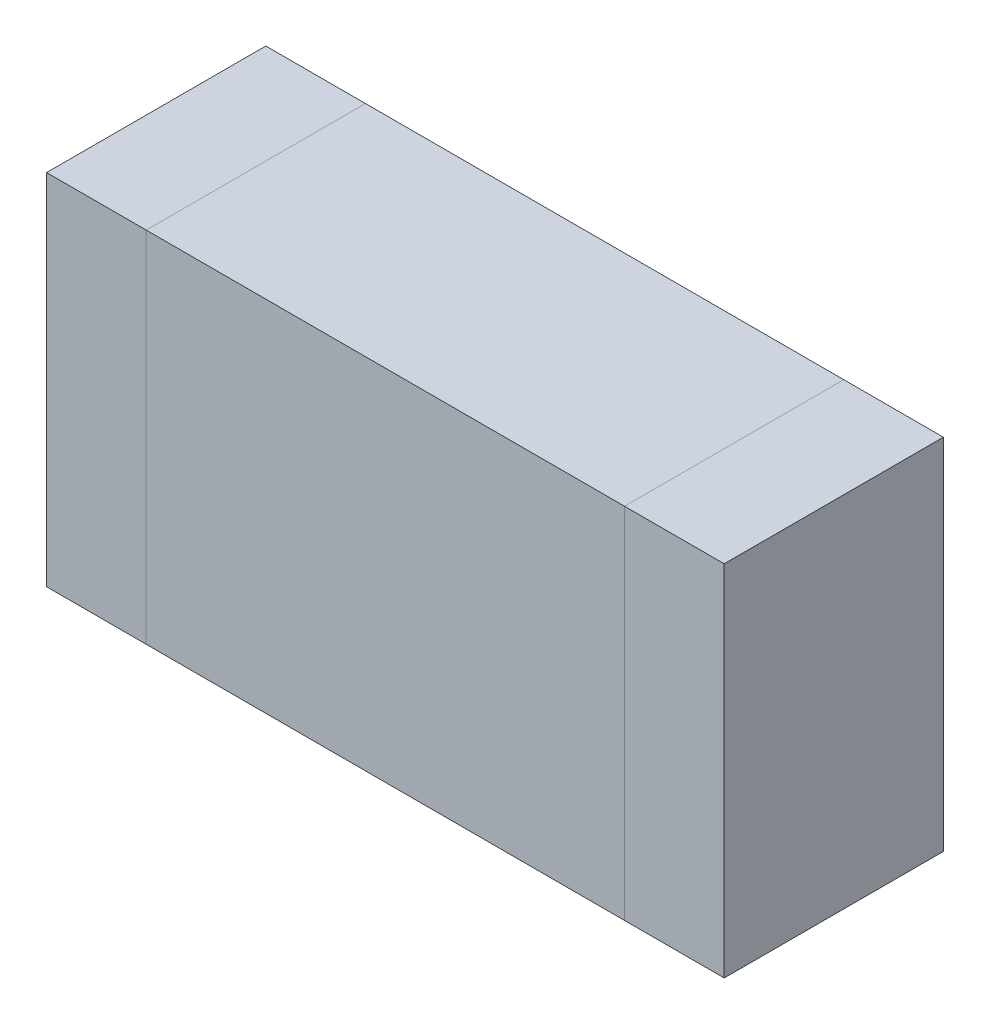
ISO-10303-21;
HEADER;
FILE_DESCRIPTION(('STEP AP214'),'2;1');
FILE_NAME('part.step','',(''),(''),'','','');
FILE_SCHEMA(('AUTOMOTIVE_DESIGN { 1 0 10303 214 1 1 1 1 }'));
ENDSEC;
DATA;
#1=APPLICATION_CONTEXT('core data for automotive mechanical design processes');
#2=APPLICATION_PROTOCOL_DEFINITION('international standard','automotive_design',2000,#1);
#3=PRODUCT_CONTEXT('',#1,'mechanical');
#4=PRODUCT('Part','Part','',(#3));
#5=PRODUCT_RELATED_PRODUCT_CATEGORY('part','',(#4));
#6=PRODUCT_DEFINITION_FORMATION('','',#4);
#7=PRODUCT_DEFINITION_CONTEXT('part definition',#1,'design');
#8=PRODUCT_DEFINITION('design','',#6,#7);
#9=PRODUCT_DEFINITION_SHAPE('','',#8);
#10=(LENGTH_UNIT() NAMED_UNIT(*) SI_UNIT(.MILLI.,.METRE.));
#11=(NAMED_UNIT(*) PLANE_ANGLE_UNIT() SI_UNIT($,.RADIAN.));
#12=(NAMED_UNIT(*) SI_UNIT($,.STERADIAN.) SOLID_ANGLE_UNIT());
#13=UNCERTAINTY_MEASURE_WITH_UNIT(LENGTH_MEASURE(1.E-05),#10,'distance_accuracy_value','');
#14=(GEOMETRIC_REPRESENTATION_CONTEXT(3) GLOBAL_UNCERTAINTY_ASSIGNED_CONTEXT((#13)) GLOBAL_UNIT_ASSIGNED_CONTEXT((#10,
#11,#12)) REPRESENTATION_CONTEXT('',''));
#15=CARTESIAN_POINT('',(0.,0.,0.));
#16=DIRECTION('',(0.,0.,1.));
#17=DIRECTION('',(1.,0.,0.));
#18=AXIS2_PLACEMENT_3D('',#15,#16,#17);
#19=CARTESIAN_POINT('',(-1.20000014,0.8999982,0.));
#20=DIRECTION('',(1.,0.,0.));
#21=DIRECTION('',(0.,-1.,0.));
#22=AXIS2_PLACEMENT_3D('',#19,#20,#21);
#23=PLANE('',#22);
#24=DIRECTION('',(0.,-1.,0.));
#25=VECTOR('',#24,1.);
#26=CARTESIAN_POINT('',(-1.20000014,0.8999982,0.));
#27=LINE('',#26,#25);
#28=CARTESIAN_POINT('',(-1.20000014,0.8999982,0.));
#29=VERTEX_POINT('',#28);
#30=CARTESIAN_POINT('',(-1.20000014,-0.90000074,0.));
#31=VERTEX_POINT('',#30);
#32=EDGE_CURVE('P0_E10',#29,#31,#27,.T.);
#33=ORIENTED_EDGE('',*,*,#32,.T.);
#34=DIRECTION('',(0.,0.,1.));
#35=VECTOR('',#34,1.);
#36=CARTESIAN_POINT('',(-1.20000014,-0.90000074,0.));
#37=LINE('',#36,#35);
#38=CARTESIAN_POINT('',(-1.20000014,-0.90000074,1.10000034));
#39=VERTEX_POINT('',#38);
#40=EDGE_CURVE('P0_E23',#31,#39,#37,.T.);
#41=ORIENTED_EDGE('',*,*,#40,.T.);
#42=DIRECTION('',(0.,-1.,0.));
#43=VECTOR('',#42,1.);
#44=CARTESIAN_POINT('',(-1.20000014,0.8999982,1.10000034));
#45=LINE('',#44,#43);
#46=CARTESIAN_POINT('',(-1.20000014,0.8999982,1.10000034));
#47=VERTEX_POINT('',#46);
#48=EDGE_CURVE('P0_E85',#47,#39,#45,.T.);
#49=ORIENTED_EDGE('',*,*,#48,.F.);
#50=DIRECTION('',(0.,0.,1.));
#51=VECTOR('',#50,1.);
#52=CARTESIAN_POINT('',(-1.20000014,0.8999982,0.));
#53=LINE('',#52,#51);
#54=EDGE_CURVE('P0_E33',#29,#47,#53,.T.);
#55=ORIENTED_EDGE('',*,*,#54,.F.);
#56=EDGE_LOOP('',(#33,#41,#49,#55));
#57=FACE_BOUND('',#56,.T.);
#58=ADVANCED_FACE('P0_F16',(#57),#23,.F.);
#59=CARTESIAN_POINT('',(-1.20000014,-0.90000074,0.));
#60=DIRECTION('',(0.,1.,0.));
#61=DIRECTION('',(1.,0.,0.));
#62=AXIS2_PLACEMENT_3D('',#59,#60,#61);
#63=PLANE('',#62);
#64=DIRECTION('',(1.,0.,0.));
#65=VECTOR('',#64,1.);
#66=CARTESIAN_POINT('',(-1.20000014,-0.90000074,0.));
#67=LINE('',#66,#65);
#68=CARTESIAN_POINT('',(1.20000014,-0.90000074,0.));
#69=VERTEX_POINT('',#68);
#70=EDGE_CURVE('P0_E81',#31,#69,#67,.T.);
#71=ORIENTED_EDGE('',*,*,#70,.T.);
#72=DIRECTION('',(0.,0.,1.));
#73=VECTOR('',#72,1.);
#74=CARTESIAN_POINT('',(1.20000014,-0.90000074,0.));
#75=LINE('',#74,#73);
#76=CARTESIAN_POINT('',(1.20000014,-0.90000074,1.10000034));
#77=VERTEX_POINT('',#76);
#78=EDGE_CURVE('P0_E79',#69,#77,#75,.T.);
#79=ORIENTED_EDGE('',*,*,#78,.T.);
#80=DIRECTION('',(1.,0.,0.));
#81=VECTOR('',#80,1.);
#82=CARTESIAN_POINT('',(-1.20000014,-0.90000074,1.10000034));
#83=LINE('',#82,#81);
#84=EDGE_CURVE('P0_E66',#39,#77,#83,.T.);
#85=ORIENTED_EDGE('',*,*,#84,.F.);
#86=ORIENTED_EDGE('',*,*,#40,.F.);
#87=EDGE_LOOP('',(#71,#79,#85,#86));
#88=FACE_BOUND('',#87,.T.);
#89=ADVANCED_FACE('P0_F88',(#88),#63,.F.);
#90=CARTESIAN_POINT('',(1.20000014,-0.90000074,0.));
#91=DIRECTION('',(-1.,0.,0.));
#92=DIRECTION('',(0.,1.,0.));
#93=AXIS2_PLACEMENT_3D('',#90,#91,#92);
#94=PLANE('',#93);
#95=DIRECTION('',(0.,1.,0.));
#96=VECTOR('',#95,1.);
#97=CARTESIAN_POINT('',(1.20000014,-0.90000074,0.));
#98=LINE('',#97,#96);
#99=CARTESIAN_POINT('',(1.20000014,0.8999982,0.));
#100=VERTEX_POINT('',#99);
#101=EDGE_CURVE('P0_E72',#69,#100,#98,.T.);
#102=ORIENTED_EDGE('',*,*,#101,.T.);
#103=DIRECTION('',(0.,0.,1.));
#104=VECTOR('',#103,1.);
#105=CARTESIAN_POINT('',(1.20000014,0.8999982,0.));
#106=LINE('',#105,#104);
#107=CARTESIAN_POINT('',(1.20000014,0.8999982,1.10000034));
#108=VERTEX_POINT('',#107);
#109=EDGE_CURVE('P0_E58',#100,#108,#106,.T.);
#110=ORIENTED_EDGE('',*,*,#109,.T.);
#111=DIRECTION('',(0.,1.,0.));
#112=VECTOR('',#111,1.);
#113=CARTESIAN_POINT('',(1.20000014,-0.90000074,1.10000034));
#114=LINE('',#113,#112);
#115=EDGE_CURVE('P0_E63',#77,#108,#114,.T.);
#116=ORIENTED_EDGE('',*,*,#115,.F.);
#117=ORIENTED_EDGE('',*,*,#78,.F.);
#118=EDGE_LOOP('',(#102,#110,#116,#117));
#119=FACE_BOUND('',#118,.T.);
#120=ADVANCED_FACE('P0_F71',(#119),#94,.F.);
#121=CARTESIAN_POINT('',(1.20000014,0.8999982,0.));
#122=DIRECTION('',(0.,-1.,0.));
#123=DIRECTION('',(-1.,0.,0.));
#124=AXIS2_PLACEMENT_3D('',#121,#122,#123);
#125=PLANE('',#124);
#126=DIRECTION('',(-1.,0.,0.));
#127=VECTOR('',#126,1.);
#128=CARTESIAN_POINT('',(1.20000014,0.8999982,0.));
#129=LINE('',#128,#127);
#130=EDGE_CURVE('P0_E60',#100,#29,#129,.T.);
#131=ORIENTED_EDGE('',*,*,#130,.T.);
#132=ORIENTED_EDGE('',*,*,#54,.T.);
#133=DIRECTION('',(-1.,0.,0.));
#134=VECTOR('',#133,1.);
#135=CARTESIAN_POINT('',(1.20000014,0.8999982,1.10000034));
#136=LINE('',#135,#134);
#137=EDGE_CURVE('P0_E53',#108,#47,#136,.T.);
#138=ORIENTED_EDGE('',*,*,#137,.F.);
#139=ORIENTED_EDGE('',*,*,#109,.F.);
#140=EDGE_LOOP('',(#131,#132,#138,#139));
#141=FACE_BOUND('',#140,.T.);
#142=ADVANCED_FACE('P0_F56',(#141),#125,.F.);
#143=CARTESIAN_POINT('',(-1.20000014,0.8999982,0.));
#144=DIRECTION('',(0.,0.,-1.));
#145=DIRECTION('',(0.,1.,0.));
#146=AXIS2_PLACEMENT_3D('',#143,#144,#145);
#147=PLANE('',#146);
#148=ORIENTED_EDGE('',*,*,#130,.F.);
#149=ORIENTED_EDGE('',*,*,#101,.F.);
#150=ORIENTED_EDGE('',*,*,#70,.F.);
#151=ORIENTED_EDGE('',*,*,#32,.F.);
#152=EDGE_LOOP('',(#148,#149,#150,#151));
#153=FACE_BOUND('',#152,.T.);
#154=ADVANCED_FACE('P0_F90',(#153),#147,.T.);
#155=CARTESIAN_POINT('',(-1.20000014,0.8999982,1.10000034));
#156=DIRECTION('',(0.,0.,-1.));
#157=DIRECTION('',(0.,1.,0.));
#158=AXIS2_PLACEMENT_3D('',#155,#156,#157);
#159=PLANE('',#158);
#160=ORIENTED_EDGE('',*,*,#48,.T.);
#161=ORIENTED_EDGE('',*,*,#84,.T.);
#162=ORIENTED_EDGE('',*,*,#115,.T.);
#163=ORIENTED_EDGE('',*,*,#137,.T.);
#164=EDGE_LOOP('',(#160,#161,#162,#163));
#165=FACE_BOUND('',#164,.T.);
#166=ADVANCED_FACE('P0_F64',(#165),#159,.F.);
#167=CLOSED_SHELL('',(#58,#89,#120,#142,#154,#166));
#168=MANIFOLD_SOLID_BREP('P0_B1',#167);
#169=CARTESIAN_POINT('',(-1.69999914,0.8999982,0.));
#170=DIRECTION('',(1.,0.,0.));
#171=DIRECTION('',(0.,-1.,0.));
#172=AXIS2_PLACEMENT_3D('',#169,#170,#171);
#173=PLANE('',#172);
#174=DIRECTION('',(0.,-1.,0.));
#175=VECTOR('',#174,1.);
#176=CARTESIAN_POINT('',(-1.69999914,0.8999982,0.));
#177=LINE('',#176,#175);
#178=CARTESIAN_POINT('',(-1.69999914,0.8999982,0.));
#179=VERTEX_POINT('',#178);
#180=CARTESIAN_POINT('',(-1.69999914,-0.90000074,0.));
#181=VERTEX_POINT('',#180);
#182=EDGE_CURVE('P1_E11',#179,#181,#177,.T.);
#183=ORIENTED_EDGE('',*,*,#182,.T.);
#184=DIRECTION('',(0.,0.,1.));
#185=VECTOR('',#184,1.);
#186=CARTESIAN_POINT('',(-1.69999914,-0.90000074,0.));
#187=LINE('',#186,#185);
#188=CARTESIAN_POINT('',(-1.69999914,-0.90000074,1.10000034));
#189=VERTEX_POINT('',#188);
#190=EDGE_CURVE('P1_E24',#181,#189,#187,.T.);
#191=ORIENTED_EDGE('',*,*,#190,.T.);
#192=DIRECTION('',(0.,-1.,0.));
#193=VECTOR('',#192,1.);
#194=CARTESIAN_POINT('',(-1.69999914,0.8999982,1.10000034));
#195=LINE('',#194,#193);
#196=CARTESIAN_POINT('',(-1.69999914,0.8999982,1.10000034));
#197=VERTEX_POINT('',#196);
#198=EDGE_CURVE('P1_E86',#197,#189,#195,.T.);
#199=ORIENTED_EDGE('',*,*,#198,.F.);
#200=DIRECTION('',(0.,0.,1.));
#201=VECTOR('',#200,1.);
#202=CARTESIAN_POINT('',(-1.69999914,0.8999982,0.));
#203=LINE('',#202,#201);
#204=EDGE_CURVE('P1_E37',#179,#197,#203,.T.);
#205=ORIENTED_EDGE('',*,*,#204,.F.);
#206=EDGE_LOOP('',(#183,#191,#199,#205));
#207=FACE_BOUND('',#206,.T.);
#208=ADVANCED_FACE('P1_F17',(#207),#173,.F.);
#209=CARTESIAN_POINT('',(-1.69999914,-0.90000074,0.));
#210=DIRECTION('',(0.,1.,0.));
#211=DIRECTION('',(1.,0.,0.));
#212=AXIS2_PLACEMENT_3D('',#209,#210,#211);
#213=PLANE('',#212);
#214=DIRECTION('',(1.,0.,0.));
#215=VECTOR('',#214,1.);
#216=CARTESIAN_POINT('',(-1.69999914,-0.90000074,0.));
#217=LINE('',#216,#215);
#218=CARTESIAN_POINT('',(-1.20000014,-0.90000074,0.));
#219=VERTEX_POINT('',#218);
#220=EDGE_CURVE('P1_E31',#181,#219,#217,.T.);
#221=ORIENTED_EDGE('',*,*,#220,.T.);
#222=DIRECTION('',(0.,0.,1.));
#223=VECTOR('',#222,1.);
#224=CARTESIAN_POINT('',(-1.20000014,-0.90000074,0.));
#225=LINE('',#224,#223);
#226=CARTESIAN_POINT('',(-1.20000014,-0.90000074,1.10000034));
#227=VERTEX_POINT('',#226);
#228=EDGE_CURVE('P1_E82',#219,#227,#225,.T.);
#229=ORIENTED_EDGE('',*,*,#228,.T.);
#230=DIRECTION('',(1.,0.,0.));
#231=VECTOR('',#230,1.);
#232=CARTESIAN_POINT('',(-1.69999914,-0.90000074,1.10000034));
#233=LINE('',#232,#231);
#234=EDGE_CURVE('P1_E62',#189,#227,#233,.T.);
#235=ORIENTED_EDGE('',*,*,#234,.F.);
#236=ORIENTED_EDGE('',*,*,#190,.F.);
#237=EDGE_LOOP('',(#221,#229,#235,#236));
#238=FACE_BOUND('',#237,.T.);
#239=ADVANCED_FACE('P1_F90',(#238),#213,.F.);
#240=CARTESIAN_POINT('',(-1.20000014,-0.90000074,0.));
#241=DIRECTION('',(-1.,0.,0.));
#242=DIRECTION('',(0.,1.,0.));
#243=AXIS2_PLACEMENT_3D('',#240,#241,#242);
#244=PLANE('',#243);
#245=DIRECTION('',(0.,1.,0.));
#246=VECTOR('',#245,1.);
#247=CARTESIAN_POINT('',(-1.20000014,-0.90000074,0.));
#248=LINE('',#247,#246);
#249=CARTESIAN_POINT('',(-1.20000014,0.8999982,0.));
#250=VERTEX_POINT('',#249);
#251=EDGE_CURVE('P1_E71',#219,#250,#248,.T.);
#252=ORIENTED_EDGE('',*,*,#251,.T.);
#253=DIRECTION('',(0.,0.,1.));
#254=VECTOR('',#253,1.);
#255=CARTESIAN_POINT('',(-1.20000014,0.8999982,0.));
#256=LINE('',#255,#254);
#257=CARTESIAN_POINT('',(-1.20000014,0.8999982,1.10000034));
#258=VERTEX_POINT('',#257);
#259=EDGE_CURVE('P1_E66',#250,#258,#256,.T.);
#260=ORIENTED_EDGE('',*,*,#259,.T.);
#261=DIRECTION('',(0.,1.,0.));
#262=VECTOR('',#261,1.);
#263=CARTESIAN_POINT('',(-1.20000014,-0.90000074,1.10000034));
#264=LINE('',#263,#262);
#265=EDGE_CURVE('P1_E56',#227,#258,#264,.T.);
#266=ORIENTED_EDGE('',*,*,#265,.F.);
#267=ORIENTED_EDGE('',*,*,#228,.F.);
#268=EDGE_LOOP('',(#252,#260,#266,#267));
#269=FACE_BOUND('',#268,.T.);
#270=ADVANCED_FACE('P1_F70',(#269),#244,.F.);
#271=CARTESIAN_POINT('',(-1.20000014,0.8999982,0.));
#272=DIRECTION('',(0.,-1.,0.));
#273=DIRECTION('',(-1.,0.,0.));
#274=AXIS2_PLACEMENT_3D('',#271,#272,#273);
#275=PLANE('',#274);
#276=DIRECTION('',(-1.,0.,0.));
#277=VECTOR('',#276,1.);
#278=CARTESIAN_POINT('',(-1.20000014,0.8999982,0.));
#279=LINE('',#278,#277);
#280=EDGE_CURVE('P1_E67',#250,#179,#279,.T.);
#281=ORIENTED_EDGE('',*,*,#280,.T.);
#282=ORIENTED_EDGE('',*,*,#204,.T.);
#283=DIRECTION('',(-1.,0.,0.));
#284=VECTOR('',#283,1.);
#285=CARTESIAN_POINT('',(-1.20000014,0.8999982,1.10000034));
#286=LINE('',#285,#284);
#287=EDGE_CURVE('P1_E60',#258,#197,#286,.T.);
#288=ORIENTED_EDGE('',*,*,#287,.F.);
#289=ORIENTED_EDGE('',*,*,#259,.F.);
#290=EDGE_LOOP('',(#281,#282,#288,#289));
#291=FACE_BOUND('',#290,.T.);
#292=ADVANCED_FACE('P1_F76',(#291),#275,.F.);
#293=CARTESIAN_POINT('',(-1.69999914,0.8999982,0.));
#294=DIRECTION('',(0.,0.,-1.));
#295=DIRECTION('',(0.,1.,0.));
#296=AXIS2_PLACEMENT_3D('',#293,#294,#295);
#297=PLANE('',#296);
#298=ORIENTED_EDGE('',*,*,#280,.F.);
#299=ORIENTED_EDGE('',*,*,#251,.F.);
#300=ORIENTED_EDGE('',*,*,#220,.F.);
#301=ORIENTED_EDGE('',*,*,#182,.F.);
#302=EDGE_LOOP('',(#298,#299,#300,#301));
#303=FACE_BOUND('',#302,.T.);
#304=ADVANCED_FACE('P1_F91',(#303),#297,.T.);
#305=CARTESIAN_POINT('',(-1.69999914,0.8999982,1.10000034));
#306=DIRECTION('',(0.,0.,-1.));
#307=DIRECTION('',(0.,1.,0.));
#308=AXIS2_PLACEMENT_3D('',#305,#306,#307);
#309=PLANE('',#308);
#310=ORIENTED_EDGE('',*,*,#198,.T.);
#311=ORIENTED_EDGE('',*,*,#234,.T.);
#312=ORIENTED_EDGE('',*,*,#265,.T.);
#313=ORIENTED_EDGE('',*,*,#287,.T.);
#314=EDGE_LOOP('',(#310,#311,#312,#313));
#315=FACE_BOUND('',#314,.T.);
#316=ADVANCED_FACE('P1_F58',(#315),#309,.F.);
#317=CLOSED_SHELL('',(#208,#239,#270,#292,#304,#316));
#318=MANIFOLD_SOLID_BREP('P1_B1',#317);
#319=CARTESIAN_POINT('',(1.20000014,0.8999982,0.));
#320=DIRECTION('',(1.,0.,0.));
#321=DIRECTION('',(0.,-1.,0.));
#322=AXIS2_PLACEMENT_3D('',#319,#320,#321);
#323=PLANE('',#322);
#324=DIRECTION('',(0.,-1.,0.));
#325=VECTOR('',#324,1.);
#326=CARTESIAN_POINT('',(1.20000014,0.8999982,0.));
#327=LINE('',#326,#325);
#328=CARTESIAN_POINT('',(1.20000014,0.8999982,0.));
#329=VERTEX_POINT('',#328);
#330=CARTESIAN_POINT('',(1.20000014,-0.90000074,0.));
#331=VERTEX_POINT('',#330);
#332=EDGE_CURVE('P2_E10',#329,#331,#327,.T.);
#333=ORIENTED_EDGE('',*,*,#332,.T.);
#334=DIRECTION('',(0.,0.,1.));
#335=VECTOR('',#334,1.);
#336=CARTESIAN_POINT('',(1.20000014,-0.90000074,0.));
#337=LINE('',#336,#335);
#338=CARTESIAN_POINT('',(1.20000014,-0.90000074,1.10000034));
#339=VERTEX_POINT('',#338);
#340=EDGE_CURVE('P2_E23',#331,#339,#337,.T.);
#341=ORIENTED_EDGE('',*,*,#340,.T.);
#342=DIRECTION('',(0.,-1.,0.));
#343=VECTOR('',#342,1.);
#344=CARTESIAN_POINT('',(1.20000014,0.8999982,1.10000034));
#345=LINE('',#344,#343);
#346=CARTESIAN_POINT('',(1.20000014,0.8999982,1.10000034));
#347=VERTEX_POINT('',#346);
#348=EDGE_CURVE('P2_E85',#347,#339,#345,.T.);
#349=ORIENTED_EDGE('',*,*,#348,.F.);
#350=DIRECTION('',(0.,0.,1.));
#351=VECTOR('',#350,1.);
#352=CARTESIAN_POINT('',(1.20000014,0.8999982,0.));
#353=LINE('',#352,#351);
#354=EDGE_CURVE('P2_E33',#329,#347,#353,.T.);
#355=ORIENTED_EDGE('',*,*,#354,.F.);
#356=EDGE_LOOP('',(#333,#341,#349,#355));
#357=FACE_BOUND('',#356,.T.);
#358=ADVANCED_FACE('P2_F16',(#357),#323,.F.);
#359=CARTESIAN_POINT('',(1.20000014,-0.90000074,0.));
#360=DIRECTION('',(0.,1.,0.));
#361=DIRECTION('',(1.,0.,0.));
#362=AXIS2_PLACEMENT_3D('',#359,#360,#361);
#363=PLANE('',#362);
#364=DIRECTION('',(1.,0.,0.));
#365=VECTOR('',#364,1.);
#366=CARTESIAN_POINT('',(1.20000014,-0.90000074,0.));
#367=LINE('',#366,#365);
#368=CARTESIAN_POINT('',(1.69999914,-0.90000074,0.));
#369=VERTEX_POINT('',#368);
#370=EDGE_CURVE('P2_E82',#331,#369,#367,.T.);
#371=ORIENTED_EDGE('',*,*,#370,.T.);
#372=DIRECTION('',(0.,0.,1.));
#373=VECTOR('',#372,1.);
#374=CARTESIAN_POINT('',(1.69999914,-0.90000074,0.));
#375=LINE('',#374,#373);
#376=CARTESIAN_POINT('',(1.69999914,-0.90000074,1.10000034));
#377=VERTEX_POINT('',#376);
#378=EDGE_CURVE('P2_E80',#369,#377,#375,.T.);
#379=ORIENTED_EDGE('',*,*,#378,.T.);
#380=DIRECTION('',(1.,0.,0.));
#381=VECTOR('',#380,1.);
#382=CARTESIAN_POINT('',(1.20000014,-0.90000074,1.10000034));
#383=LINE('',#382,#381);
#384=EDGE_CURVE('P2_E73',#339,#377,#383,.T.);
#385=ORIENTED_EDGE('',*,*,#384,.F.);
#386=ORIENTED_EDGE('',*,*,#340,.F.);
#387=EDGE_LOOP('',(#371,#379,#385,#386));
#388=FACE_BOUND('',#387,.T.);
#389=ADVANCED_FACE('P2_F88',(#388),#363,.F.);
#390=CARTESIAN_POINT('',(1.69999914,-0.90000074,0.));
#391=DIRECTION('',(-1.,0.,0.));
#392=DIRECTION('',(0.,1.,0.));
#393=AXIS2_PLACEMENT_3D('',#390,#391,#392);
#394=PLANE('',#393);
#395=DIRECTION('',(0.,1.,0.));
#396=VECTOR('',#395,1.);
#397=CARTESIAN_POINT('',(1.69999914,-0.90000074,0.));
#398=LINE('',#397,#396);
#399=CARTESIAN_POINT('',(1.69999914,0.8999982,0.));
#400=VERTEX_POINT('',#399);
#401=EDGE_CURVE('P2_E60',#369,#400,#398,.T.);
#402=ORIENTED_EDGE('',*,*,#401,.T.);
#403=DIRECTION('',(0.,0.,1.));
#404=VECTOR('',#403,1.);
#405=CARTESIAN_POINT('',(1.69999914,0.8999982,0.));
#406=LINE('',#405,#404);
#407=CARTESIAN_POINT('',(1.69999914,0.8999982,1.10000034));
#408=VERTEX_POINT('',#407);
#409=EDGE_CURVE('P2_E53',#400,#408,#406,.T.);
#410=ORIENTED_EDGE('',*,*,#409,.T.);
#411=DIRECTION('',(0.,1.,0.));
#412=VECTOR('',#411,1.);
#413=CARTESIAN_POINT('',(1.69999914,-0.90000074,1.10000034));
#414=LINE('',#413,#412);
#415=EDGE_CURVE('P2_E58',#377,#408,#414,.T.);
#416=ORIENTED_EDGE('',*,*,#415,.F.);
#417=ORIENTED_EDGE('',*,*,#378,.F.);
#418=EDGE_LOOP('',(#402,#410,#416,#417));
#419=FACE_BOUND('',#418,.T.);
#420=ADVANCED_FACE('P2_F55',(#419),#394,.F.);
#421=CARTESIAN_POINT('',(1.69999914,0.8999982,0.));
#422=DIRECTION('',(0.,-1.,0.));
#423=DIRECTION('',(-1.,0.,0.));
#424=AXIS2_PLACEMENT_3D('',#421,#422,#423);
#425=PLANE('',#424);
#426=DIRECTION('',(-1.,0.,0.));
#427=VECTOR('',#426,1.);
#428=CARTESIAN_POINT('',(1.69999914,0.8999982,0.));
#429=LINE('',#428,#427);
#430=EDGE_CURVE('P2_E69',#400,#329,#429,.T.);
#431=ORIENTED_EDGE('',*,*,#430,.T.);
#432=ORIENTED_EDGE('',*,*,#354,.T.);
#433=DIRECTION('',(-1.,0.,0.));
#434=VECTOR('',#433,1.);
#435=CARTESIAN_POINT('',(1.69999914,0.8999982,1.10000034));
#436=LINE('',#435,#434);
#437=EDGE_CURVE('P2_E66',#408,#347,#436,.T.);
#438=ORIENTED_EDGE('',*,*,#437,.F.);
#439=ORIENTED_EDGE('',*,*,#409,.F.);
#440=EDGE_LOOP('',(#431,#432,#438,#439));
#441=FACE_BOUND('',#440,.T.);
#442=ADVANCED_FACE('P2_F67',(#441),#425,.F.);
#443=CARTESIAN_POINT('',(1.20000014,0.8999982,0.));
#444=DIRECTION('',(0.,0.,-1.));
#445=DIRECTION('',(0.,1.,0.));
#446=AXIS2_PLACEMENT_3D('',#443,#444,#445);
#447=PLANE('',#446);
#448=ORIENTED_EDGE('',*,*,#430,.F.);
#449=ORIENTED_EDGE('',*,*,#401,.F.);
#450=ORIENTED_EDGE('',*,*,#370,.F.);
#451=ORIENTED_EDGE('',*,*,#332,.F.);
#452=EDGE_LOOP('',(#448,#449,#450,#451));
#453=FACE_BOUND('',#452,.T.);
#454=ADVANCED_FACE('P2_F90',(#453),#447,.T.);
#455=CARTESIAN_POINT('',(1.20000014,0.8999982,1.10000034));
#456=DIRECTION('',(0.,0.,-1.));
#457=DIRECTION('',(0.,1.,0.));
#458=AXIS2_PLACEMENT_3D('',#455,#456,#457);
#459=PLANE('',#458);
#460=ORIENTED_EDGE('',*,*,#348,.T.);
#461=ORIENTED_EDGE('',*,*,#384,.T.);
#462=ORIENTED_EDGE('',*,*,#415,.T.);
#463=ORIENTED_EDGE('',*,*,#437,.T.);
#464=EDGE_LOOP('',(#460,#461,#462,#463));
#465=FACE_BOUND('',#464,.T.);
#466=ADVANCED_FACE('P2_F71',(#465),#459,.F.);
#467=CLOSED_SHELL('',(#358,#389,#420,#442,#454,#466));
#468=MANIFOLD_SOLID_BREP('P2_B1',#467);
#469=ADVANCED_BREP_SHAPE_REPRESENTATION('',(#18,#168,#318,#468),#14);
#470=SHAPE_DEFINITION_REPRESENTATION(#9,#469);
ENDSEC;
END-ISO-10303-21;
